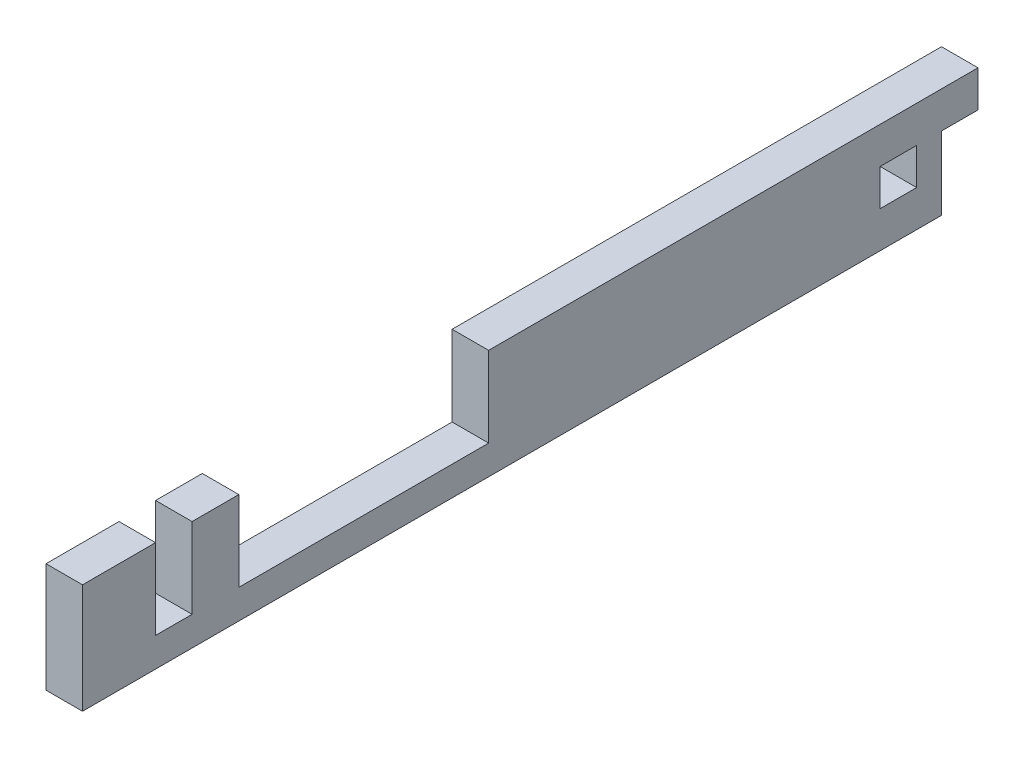
ISO-10303-21;
HEADER;
FILE_DESCRIPTION(('STEP AP214'),'2;1');
FILE_NAME('part.step','',(''),(''),'','','');
FILE_SCHEMA(('AUTOMOTIVE_DESIGN { 1 0 10303 214 1 1 1 1 }'));
ENDSEC;
DATA;
#1=APPLICATION_CONTEXT('core data for automotive mechanical design processes');
#2=APPLICATION_PROTOCOL_DEFINITION('international standard','automotive_design',2000,#1);
#3=PRODUCT_CONTEXT('',#1,'mechanical');
#4=PRODUCT('Part','Part','',(#3));
#5=PRODUCT_RELATED_PRODUCT_CATEGORY('part','',(#4));
#6=PRODUCT_DEFINITION_FORMATION('','',#4);
#7=PRODUCT_DEFINITION_CONTEXT('part definition',#1,'design');
#8=PRODUCT_DEFINITION('design','',#6,#7);
#9=PRODUCT_DEFINITION_SHAPE('','',#8);
#10=(LENGTH_UNIT() NAMED_UNIT(*) SI_UNIT(.MILLI.,.METRE.));
#11=(NAMED_UNIT(*) PLANE_ANGLE_UNIT() SI_UNIT($,.RADIAN.));
#12=(NAMED_UNIT(*) SI_UNIT($,.STERADIAN.) SOLID_ANGLE_UNIT());
#13=UNCERTAINTY_MEASURE_WITH_UNIT(LENGTH_MEASURE(1.E-05),#10,'distance_accuracy_value','');
#14=(GEOMETRIC_REPRESENTATION_CONTEXT(3) GLOBAL_UNCERTAINTY_ASSIGNED_CONTEXT((#13)) GLOBAL_UNIT_ASSIGNED_CONTEXT((#10,
#11,#12)) REPRESENTATION_CONTEXT('',''));
#15=CARTESIAN_POINT('',(0.,0.,0.));
#16=DIRECTION('',(0.,0.,1.));
#17=DIRECTION('',(1.,0.,0.));
#18=AXIS2_PLACEMENT_3D('',#15,#16,#17);
#19=CARTESIAN_POINT('',(0.,19.05,0.));
#20=DIRECTION('',(0.,1.,0.));
#21=DIRECTION('',(0.,0.,1.));
#22=AXIS2_PLACEMENT_3D('',#19,#20,#21);
#23=PLANE('',#22);
#24=DIRECTION('',(-1.,0.,0.));
#25=VECTOR('',#24,1.);
#26=CARTESIAN_POINT('',(0.,19.05,8.255));
#27=LINE('',#26,#25);
#28=CARTESIAN_POINT('',(-11.6205,19.05,8.255));
#29=VERTEX_POINT('',#28);
#30=CARTESIAN_POINT('',(-17.9705,19.05,8.255));
#31=VERTEX_POINT('',#30);
#32=EDGE_CURVE('E272',#29,#31,#27,.T.);
#33=ORIENTED_EDGE('',*,*,#32,.F.);
#34=DIRECTION('',(0.,0.,-1.));
#35=VECTOR('',#34,1.);
#36=CARTESIAN_POINT('',(-11.6205,19.05,-76.835));
#37=LINE('',#36,#35);
#38=CARTESIAN_POINT('',(-11.6205,19.05,-76.835));
#39=VERTEX_POINT('',#38);
#40=EDGE_CURVE('E230',#29,#39,#37,.T.);
#41=ORIENTED_EDGE('',*,*,#40,.T.);
#42=DIRECTION('',(-1.,0.,0.));
#43=VECTOR('',#42,1.);
#44=CARTESIAN_POINT('',(-17.9705,19.05,-76.835));
#45=LINE('',#44,#43);
#46=CARTESIAN_POINT('',(-17.9705,19.05,-76.835));
#47=VERTEX_POINT('',#46);
#48=EDGE_CURVE('E232',#39,#47,#45,.T.);
#49=ORIENTED_EDGE('',*,*,#48,.T.);
#50=DIRECTION('',(0.,0.,1.));
#51=VECTOR('',#50,1.);
#52=CARTESIAN_POINT('',(-17.9705,19.05,78.867));
#53=LINE('',#52,#51);
#54=EDGE_CURVE('E235',#47,#31,#53,.T.);
#55=ORIENTED_EDGE('',*,*,#54,.T.);
#56=EDGE_LOOP('',(#33,#41,#49,#55));
#57=FACE_BOUND('',#56,.T.);
#58=ADVANCED_FACE('F36',(#57),#23,.T.);
#59=CARTESIAN_POINT('',(0.,0.,0.));
#60=DIRECTION('',(0.,1.,0.));
#61=DIRECTION('',(0.,0.,1.));
#62=AXIS2_PLACEMENT_3D('',#59,#60,#61);
#63=PLANE('',#62);
#64=DIRECTION('',(0.,0.,-1.));
#65=VECTOR('',#64,1.);
#66=CARTESIAN_POINT('',(-11.6205,0.,59.817));
#67=LINE('',#66,#65);
#68=CARTESIAN_POINT('',(-11.6205,0.,78.867));
#69=VERTEX_POINT('',#68);
#70=CARTESIAN_POINT('',(-11.6205,0.,-70.485));
#71=VERTEX_POINT('',#70);
#72=EDGE_CURVE('E59',#69,#71,#67,.T.);
#73=ORIENTED_EDGE('',*,*,#72,.F.);
#74=DIRECTION('',(1.,0.,0.));
#75=VECTOR('',#74,1.);
#76=CARTESIAN_POINT('',(-17.9705,0.,78.867));
#77=LINE('',#76,#75);
#78=CARTESIAN_POINT('',(-17.9705,0.,78.867));
#79=VERTEX_POINT('',#78);
#80=EDGE_CURVE('E248',#79,#69,#77,.T.);
#81=ORIENTED_EDGE('',*,*,#80,.F.);
#82=DIRECTION('',(0.,0.,1.));
#83=VECTOR('',#82,1.);
#84=CARTESIAN_POINT('',(-17.9705,0.,78.867));
#85=LINE('',#84,#83);
#86=CARTESIAN_POINT('',(-17.9705,0.,-70.485));
#87=VERTEX_POINT('',#86);
#88=EDGE_CURVE('E229',#87,#79,#85,.T.);
#89=ORIENTED_EDGE('',*,*,#88,.F.);
#90=DIRECTION('',(1.,0.,0.));
#91=VECTOR('',#90,1.);
#92=CARTESIAN_POINT('',(0.,0.,-70.485));
#93=LINE('',#92,#91);
#94=EDGE_CURVE('E277',#87,#71,#93,.T.);
#95=ORIENTED_EDGE('',*,*,#94,.T.);
#96=EDGE_LOOP('',(#73,#81,#89,#95));
#97=FACE_BOUND('',#96,.T.);
#98=ADVANCED_FACE('F333',(#97),#63,.F.);
#99=CARTESIAN_POINT('',(17.9705,5.08,59.817));
#100=DIRECTION('',(0.,-1.,0.));
#101=DIRECTION('',(0.,0.,-1.));
#102=AXIS2_PLACEMENT_3D('',#99,#100,#101);
#103=PLANE('',#102);
#104=DIRECTION('',(0.,0.,1.));
#105=VECTOR('',#104,1.);
#106=CARTESIAN_POINT('',(-11.6205,5.08,59.817));
#107=LINE('',#106,#105);
#108=CARTESIAN_POINT('',(-11.6205,5.08,59.817));
#109=VERTEX_POINT('',#108);
#110=CARTESIAN_POINT('',(-11.6205,5.08,66.167));
#111=VERTEX_POINT('',#110);
#112=EDGE_CURVE('E171',#109,#111,#107,.T.);
#113=ORIENTED_EDGE('',*,*,#112,.F.);
#114=DIRECTION('',(-1.,0.,0.));
#115=VECTOR('',#114,1.);
#116=CARTESIAN_POINT('',(17.9705,5.08,59.817));
#117=LINE('',#116,#115);
#118=CARTESIAN_POINT('',(-17.9705,5.08,59.817));
#119=VERTEX_POINT('',#118);
#120=EDGE_CURVE('E303',#109,#119,#117,.T.);
#121=ORIENTED_EDGE('',*,*,#120,.T.);
#122=DIRECTION('',(0.,0.,1.));
#123=VECTOR('',#122,1.);
#124=CARTESIAN_POINT('',(-17.9705,5.08,59.817));
#125=LINE('',#124,#123);
#126=CARTESIAN_POINT('',(-17.9705,5.08,66.167));
#127=VERTEX_POINT('',#126);
#128=EDGE_CURVE('E188',#119,#127,#125,.T.);
#129=ORIENTED_EDGE('',*,*,#128,.T.);
#130=DIRECTION('',(-1.,0.,0.));
#131=VECTOR('',#130,1.);
#132=CARTESIAN_POINT('',(17.9705,5.08,66.167));
#133=LINE('',#132,#131);
#134=EDGE_CURVE('E179',#111,#127,#133,.T.);
#135=ORIENTED_EDGE('',*,*,#134,.F.);
#136=EDGE_LOOP('',(#113,#121,#129,#135));
#137=FACE_BOUND('',#136,.T.);
#138=ADVANCED_FACE('F328',(#137),#103,.F.);
#139=CARTESIAN_POINT('',(17.9705,12.7,-66.167));
#140=DIRECTION('',(0.,1.,0.));
#141=DIRECTION('',(0.,0.,1.));
#142=AXIS2_PLACEMENT_3D('',#139,#140,#141);
#143=PLANE('',#142);
#144=DIRECTION('',(0.,0.,-1.));
#145=VECTOR('',#144,1.);
#146=CARTESIAN_POINT('',(-11.6205,12.7,-66.167));
#147=LINE('',#146,#145);
#148=CARTESIAN_POINT('',(-11.6205,12.7,-59.817));
#149=VERTEX_POINT('',#148);
#150=CARTESIAN_POINT('',(-11.6205,12.7,-66.167));
#151=VERTEX_POINT('',#150);
#152=EDGE_CURVE('E162',#149,#151,#147,.T.);
#153=ORIENTED_EDGE('',*,*,#152,.F.);
#154=DIRECTION('',(-1.,0.,0.));
#155=VECTOR('',#154,1.);
#156=CARTESIAN_POINT('',(17.9705,12.7,-59.817));
#157=LINE('',#156,#155);
#158=CARTESIAN_POINT('',(-17.9705,12.7,-59.817));
#159=VERTEX_POINT('',#158);
#160=EDGE_CURVE('E185',#149,#159,#157,.T.);
#161=ORIENTED_EDGE('',*,*,#160,.T.);
#162=DIRECTION('',(0.,0.,-1.));
#163=VECTOR('',#162,1.);
#164=CARTESIAN_POINT('',(-17.9705,12.7,-66.167));
#165=LINE('',#164,#163);
#166=CARTESIAN_POINT('',(-17.9705,12.7,-66.167));
#167=VERTEX_POINT('',#166);
#168=EDGE_CURVE('E183',#159,#167,#165,.T.);
#169=ORIENTED_EDGE('',*,*,#168,.T.);
#170=DIRECTION('',(-1.,0.,0.));
#171=VECTOR('',#170,1.);
#172=CARTESIAN_POINT('',(17.9705,12.7,-66.167));
#173=LINE('',#172,#171);
#174=EDGE_CURVE('E175',#151,#167,#173,.T.);
#175=ORIENTED_EDGE('',*,*,#174,.F.);
#176=EDGE_LOOP('',(#153,#161,#169,#175));
#177=FACE_BOUND('',#176,.T.);
#178=ADVANCED_FACE('F181',(#177),#143,.F.);
#179=CARTESIAN_POINT('',(17.9705,6.35,-66.167));
#180=DIRECTION('',(0.,-1.,0.));
#181=DIRECTION('',(0.,0.,-1.));
#182=AXIS2_PLACEMENT_3D('',#179,#180,#181);
#183=PLANE('',#182);
#184=DIRECTION('',(0.,0.,1.));
#185=VECTOR('',#184,1.);
#186=CARTESIAN_POINT('',(-11.6205,6.35,-66.167));
#187=LINE('',#186,#185);
#188=CARTESIAN_POINT('',(-11.6205,6.35,-66.167));
#189=VERTEX_POINT('',#188);
#190=CARTESIAN_POINT('',(-11.6205,6.35,-59.817));
#191=VERTEX_POINT('',#190);
#192=EDGE_CURVE('E172',#189,#191,#187,.T.);
#193=ORIENTED_EDGE('',*,*,#192,.F.);
#194=DIRECTION('',(-1.,0.,0.));
#195=VECTOR('',#194,1.);
#196=CARTESIAN_POINT('',(17.9705,6.35,-66.167));
#197=LINE('',#196,#195);
#198=CARTESIAN_POINT('',(-17.9705,6.35,-66.167));
#199=VERTEX_POINT('',#198);
#200=EDGE_CURVE('E177',#189,#199,#197,.T.);
#201=ORIENTED_EDGE('',*,*,#200,.T.);
#202=DIRECTION('',(0.,0.,1.));
#203=VECTOR('',#202,1.);
#204=CARTESIAN_POINT('',(-17.9705,6.35,-66.167));
#205=LINE('',#204,#203);
#206=CARTESIAN_POINT('',(-17.9705,6.35,-59.817));
#207=VERTEX_POINT('',#206);
#208=EDGE_CURVE('E296',#199,#207,#205,.T.);
#209=ORIENTED_EDGE('',*,*,#208,.T.);
#210=DIRECTION('',(-1.,0.,0.));
#211=VECTOR('',#210,1.);
#212=CARTESIAN_POINT('',(17.9705,6.35,-59.817));
#213=LINE('',#212,#211);
#214=EDGE_CURVE('E190',#191,#207,#213,.T.);
#215=ORIENTED_EDGE('',*,*,#214,.F.);
#216=EDGE_LOOP('',(#193,#201,#209,#215));
#217=FACE_BOUND('',#216,.T.);
#218=ADVANCED_FACE('F318',(#217),#183,.F.);
#219=DIRECTION('',(-1.,0.,0.));
#220=VECTOR('',#219,1.);
#221=CARTESIAN_POINT('',(0.,19.05,59.817));
#222=LINE('',#221,#220);
#223=CARTESIAN_POINT('',(-11.6205,19.05,59.817));
#224=VERTEX_POINT('',#223);
#225=CARTESIAN_POINT('',(-17.9705,19.05,59.817));
#226=VERTEX_POINT('',#225);
#227=EDGE_CURVE('E11',#224,#226,#222,.T.);
#228=ORIENTED_EDGE('',*,*,#227,.F.);
#229=DIRECTION('',(0.,0.,-1.));
#230=VECTOR('',#229,1.);
#231=CARTESIAN_POINT('',(-11.6205,19.05,59.817));
#232=LINE('',#231,#230);
#233=CARTESIAN_POINT('',(-11.6205,19.05,51.689));
#234=VERTEX_POINT('',#233);
#235=EDGE_CURVE('E244',#224,#234,#232,.T.);
#236=ORIENTED_EDGE('',*,*,#235,.T.);
#237=DIRECTION('',(1.,0.,0.));
#238=VECTOR('',#237,1.);
#239=CARTESIAN_POINT('',(0.,19.05,51.689));
#240=LINE('',#239,#238);
#241=CARTESIAN_POINT('',(-17.9705,19.05,51.689));
#242=VERTEX_POINT('',#241);
#243=EDGE_CURVE('E270',#242,#234,#240,.T.);
#244=ORIENTED_EDGE('',*,*,#243,.F.);
#245=EDGE_CURVE('E239',#242,#226,#53,.T.);
#246=ORIENTED_EDGE('',*,*,#245,.T.);
#247=EDGE_LOOP('',(#228,#236,#244,#246));
#248=FACE_BOUND('',#247,.T.);
#249=ADVANCED_FACE('F320',(#248),#23,.T.);
#250=DIRECTION('',(1.,0.,0.));
#251=VECTOR('',#250,1.);
#252=CARTESIAN_POINT('',(0.,19.05,66.167));
#253=LINE('',#252,#251);
#254=CARTESIAN_POINT('',(-17.9705,19.05,66.167));
#255=VERTEX_POINT('',#254);
#256=CARTESIAN_POINT('',(-11.6205,19.05,66.167));
#257=VERTEX_POINT('',#256);
#258=EDGE_CURVE('E44',#255,#257,#253,.T.);
#259=ORIENTED_EDGE('',*,*,#258,.F.);
#260=CARTESIAN_POINT('',(-17.9705,19.05,78.867));
#261=VERTEX_POINT('',#260);
#262=EDGE_CURVE('E234',#255,#261,#53,.T.);
#263=ORIENTED_EDGE('',*,*,#262,.T.);
#264=DIRECTION('',(1.,0.,0.));
#265=VECTOR('',#264,1.);
#266=CARTESIAN_POINT('',(-17.9705,19.05,78.867));
#267=LINE('',#266,#265);
#268=CARTESIAN_POINT('',(-11.6205,19.05,78.867));
#269=VERTEX_POINT('',#268);
#270=EDGE_CURVE('E238',#261,#269,#267,.T.);
#271=ORIENTED_EDGE('',*,*,#270,.T.);
#272=DIRECTION('',(0.,0.,-1.));
#273=VECTOR('',#272,1.);
#274=CARTESIAN_POINT('',(-11.6205,19.05,66.167));
#275=LINE('',#274,#273);
#276=EDGE_CURVE('E241',#269,#257,#275,.T.);
#277=ORIENTED_EDGE('',*,*,#276,.T.);
#278=EDGE_LOOP('',(#259,#263,#271,#277));
#279=FACE_BOUND('',#278,.T.);
#280=ADVANCED_FACE('F289',(#279),#23,.T.);
#281=CARTESIAN_POINT('',(-17.9705,19.05,-76.835));
#282=DIRECTION('',(0.,0.,1.));
#283=DIRECTION('',(1.,0.,0.));
#284=AXIS2_PLACEMENT_3D('',#281,#282,#283);
#285=PLANE('',#284);
#286=DIRECTION('',(0.,-1.,0.));
#287=VECTOR('',#286,1.);
#288=CARTESIAN_POINT('',(-11.6205,19.05,-76.835));
#289=LINE('',#288,#287);
#290=CARTESIAN_POINT('',(-11.6205,12.7,-76.835));
#291=VERTEX_POINT('',#290);
#292=EDGE_CURVE('E267',#39,#291,#289,.T.);
#293=ORIENTED_EDGE('',*,*,#292,.T.);
#294=DIRECTION('',(-1.,0.,0.));
#295=VECTOR('',#294,1.);
#296=CARTESIAN_POINT('',(17.9705,12.7,-76.835));
#297=LINE('',#296,#295);
#298=CARTESIAN_POINT('',(-17.9705,12.7,-76.835));
#299=VERTEX_POINT('',#298);
#300=EDGE_CURVE('E202',#291,#299,#297,.T.);
#301=ORIENTED_EDGE('',*,*,#300,.T.);
#302=DIRECTION('',(0.,-1.,0.));
#303=VECTOR('',#302,1.);
#304=CARTESIAN_POINT('',(-17.9705,19.05,-76.835));
#305=LINE('',#304,#303);
#306=EDGE_CURVE('E264',#47,#299,#305,.T.);
#307=ORIENTED_EDGE('',*,*,#306,.F.);
#308=ORIENTED_EDGE('',*,*,#48,.F.);
#309=EDGE_LOOP('',(#293,#301,#307,#308));
#310=FACE_BOUND('',#309,.T.);
#311=ADVANCED_FACE('F38',(#310),#285,.F.);
#312=CARTESIAN_POINT('',(-17.9705,19.05,78.867));
#313=DIRECTION('',(1.,0.,0.));
#314=DIRECTION('',(0.,0.,-1.));
#315=AXIS2_PLACEMENT_3D('',#312,#313,#314);
#316=PLANE('',#315);
#317=ORIENTED_EDGE('',*,*,#208,.F.);
#318=DIRECTION('',(0.,-1.,0.));
#319=VECTOR('',#318,1.);
#320=CARTESIAN_POINT('',(-17.9705,12.7,-66.167));
#321=LINE('',#320,#319);
#322=EDGE_CURVE('E51',#167,#199,#321,.T.);
#323=ORIENTED_EDGE('',*,*,#322,.F.);
#324=ORIENTED_EDGE('',*,*,#168,.F.);
#325=DIRECTION('',(0.,1.,0.));
#326=VECTOR('',#325,1.);
#327=CARTESIAN_POINT('',(-17.9705,12.7,-59.817));
#328=LINE('',#327,#326);
#329=EDGE_CURVE('E307',#207,#159,#328,.T.);
#330=ORIENTED_EDGE('',*,*,#329,.F.);
#331=EDGE_LOOP('',(#317,#323,#324,#330));
#332=FACE_BOUND('',#331,.T.);
#333=ORIENTED_EDGE('',*,*,#128,.F.);
#334=DIRECTION('',(0.,-1.,0.));
#335=VECTOR('',#334,1.);
#336=CARTESIAN_POINT('',(-17.9705,19.05,59.817));
#337=LINE('',#336,#335);
#338=EDGE_CURVE('E184',#226,#119,#337,.T.);
#339=ORIENTED_EDGE('',*,*,#338,.F.);
#340=ORIENTED_EDGE('',*,*,#245,.F.);
#341=DIRECTION('',(0.,1.,0.));
#342=VECTOR('',#341,1.);
#343=CARTESIAN_POINT('',(-17.9705,19.05,51.689));
#344=LINE('',#343,#342);
#345=CARTESIAN_POINT('',(-17.9705,5.08,51.689));
#346=VERTEX_POINT('',#345);
#347=EDGE_CURVE('E217',#346,#242,#344,.T.);
#348=ORIENTED_EDGE('',*,*,#347,.F.);
#349=DIRECTION('',(0.,0.,1.));
#350=VECTOR('',#349,1.);
#351=CARTESIAN_POINT('',(-17.9705,5.08,8.255));
#352=LINE('',#351,#350);
#353=CARTESIAN_POINT('',(-17.9705,5.08,8.255));
#354=VERTEX_POINT('',#353);
#355=EDGE_CURVE('E214',#354,#346,#352,.T.);
#356=ORIENTED_EDGE('',*,*,#355,.F.);
#357=DIRECTION('',(0.,-1.,0.));
#358=VECTOR('',#357,1.);
#359=CARTESIAN_POINT('',(-17.9705,19.05,8.255));
#360=LINE('',#359,#358);
#361=EDGE_CURVE('E211',#31,#354,#360,.T.);
#362=ORIENTED_EDGE('',*,*,#361,.F.);
#363=ORIENTED_EDGE('',*,*,#54,.F.);
#364=ORIENTED_EDGE('',*,*,#306,.T.);
#365=DIRECTION('',(0.,0.,-1.));
#366=VECTOR('',#365,1.);
#367=CARTESIAN_POINT('',(-17.9705,12.7,-76.835));
#368=LINE('',#367,#366);
#369=CARTESIAN_POINT('',(-17.9705,12.7,-70.485));
#370=VERTEX_POINT('',#369);
#371=EDGE_CURVE('E199',#370,#299,#368,.T.);
#372=ORIENTED_EDGE('',*,*,#371,.F.);
#373=DIRECTION('',(0.,1.,0.));
#374=VECTOR('',#373,1.);
#375=CARTESIAN_POINT('',(-17.9705,0.,-70.485));
#376=LINE('',#375,#374);
#377=EDGE_CURVE('E178',#87,#370,#376,.T.);
#378=ORIENTED_EDGE('',*,*,#377,.F.);
#379=ORIENTED_EDGE('',*,*,#88,.T.);
#380=DIRECTION('',(0.,-1.,0.));
#381=VECTOR('',#380,1.);
#382=CARTESIAN_POINT('',(-17.9705,19.05,78.867));
#383=LINE('',#382,#381);
#384=EDGE_CURVE('E261',#261,#79,#383,.T.);
#385=ORIENTED_EDGE('',*,*,#384,.F.);
#386=ORIENTED_EDGE('',*,*,#262,.F.);
#387=DIRECTION('',(0.,1.,0.));
#388=VECTOR('',#387,1.);
#389=CARTESIAN_POINT('',(-17.9705,19.05,66.167));
#390=LINE('',#389,#388);
#391=EDGE_CURVE('E285',#127,#255,#390,.T.);
#392=ORIENTED_EDGE('',*,*,#391,.F.);
#393=EDGE_LOOP('',(#333,#339,#340,#348,#356,#362,#363,#364,#372,#378,#379,#385,#386,#392));
#394=FACE_BOUND('',#393,.T.);
#395=ADVANCED_FACE('F315',(#332,#394),#316,.F.);
#396=CARTESIAN_POINT('',(-17.9705,19.05,78.867));
#397=DIRECTION('',(0.,0.,-1.));
#398=DIRECTION('',(-1.,0.,0.));
#399=AXIS2_PLACEMENT_3D('',#396,#397,#398);
#400=PLANE('',#399);
#401=ORIENTED_EDGE('',*,*,#80,.T.);
#402=DIRECTION('',(0.,-1.,0.));
#403=VECTOR('',#402,1.);
#404=CARTESIAN_POINT('',(-11.6205,19.05,78.867));
#405=LINE('',#404,#403);
#406=EDGE_CURVE('E259',#269,#69,#405,.T.);
#407=ORIENTED_EDGE('',*,*,#406,.F.);
#408=ORIENTED_EDGE('',*,*,#270,.F.);
#409=ORIENTED_EDGE('',*,*,#384,.T.);
#410=EDGE_LOOP('',(#401,#407,#408,#409));
#411=FACE_BOUND('',#410,.T.);
#412=ADVANCED_FACE('F350',(#411),#400,.F.);
#413=CARTESIAN_POINT('',(-11.6205,19.05,59.817));
#414=DIRECTION('',(-1.,0.,0.));
#415=DIRECTION('',(0.,0.,1.));
#416=AXIS2_PLACEMENT_3D('',#413,#414,#415);
#417=PLANE('',#416);
#418=ORIENTED_EDGE('',*,*,#152,.T.);
#419=DIRECTION('',(0.,-1.,0.));
#420=VECTOR('',#419,1.);
#421=CARTESIAN_POINT('',(-11.6205,19.05,-66.167));
#422=LINE('',#421,#420);
#423=EDGE_CURVE('E165',#151,#189,#422,.T.);
#424=ORIENTED_EDGE('',*,*,#423,.T.);
#425=ORIENTED_EDGE('',*,*,#192,.T.);
#426=DIRECTION('',(0.,-1.,0.));
#427=VECTOR('',#426,1.);
#428=CARTESIAN_POINT('',(-11.6205,19.05,-59.817));
#429=LINE('',#428,#427);
#430=EDGE_CURVE('E167',#149,#191,#429,.T.);
#431=ORIENTED_EDGE('',*,*,#430,.F.);
#432=EDGE_LOOP('',(#418,#424,#425,#431));
#433=FACE_BOUND('',#432,.T.);
#434=ORIENTED_EDGE('',*,*,#40,.F.);
#435=DIRECTION('',(0.,-1.,0.));
#436=VECTOR('',#435,1.);
#437=CARTESIAN_POINT('',(-11.6205,19.05,8.255));
#438=LINE('',#437,#436);
#439=CARTESIAN_POINT('',(-11.6205,5.08,8.255));
#440=VERTEX_POINT('',#439);
#441=EDGE_CURVE('E226',#29,#440,#438,.T.);
#442=ORIENTED_EDGE('',*,*,#441,.T.);
#443=DIRECTION('',(0.,0.,1.));
#444=VECTOR('',#443,1.);
#445=CARTESIAN_POINT('',(-11.6205,5.08,59.817));
#446=LINE('',#445,#444);
#447=CARTESIAN_POINT('',(-11.6205,5.08,51.689));
#448=VERTEX_POINT('',#447);
#449=EDGE_CURVE('E274',#440,#448,#446,.T.);
#450=ORIENTED_EDGE('',*,*,#449,.T.);
#451=DIRECTION('',(0.,1.,0.));
#452=VECTOR('',#451,1.);
#453=CARTESIAN_POINT('',(-11.6205,19.05,51.689));
#454=LINE('',#453,#452);
#455=EDGE_CURVE('E222',#448,#234,#454,.T.);
#456=ORIENTED_EDGE('',*,*,#455,.T.);
#457=ORIENTED_EDGE('',*,*,#235,.F.);
#458=DIRECTION('',(0.,-1.,0.));
#459=VECTOR('',#458,1.);
#460=CARTESIAN_POINT('',(-11.6205,19.05,59.817));
#461=LINE('',#460,#459);
#462=EDGE_CURVE('E253',#224,#109,#461,.T.);
#463=ORIENTED_EDGE('',*,*,#462,.T.);
#464=ORIENTED_EDGE('',*,*,#112,.T.);
#465=DIRECTION('',(0.,-1.,0.));
#466=VECTOR('',#465,1.);
#467=CARTESIAN_POINT('',(-11.6205,19.05,66.167));
#468=LINE('',#467,#466);
#469=EDGE_CURVE('E256',#257,#111,#468,.T.);
#470=ORIENTED_EDGE('',*,*,#469,.F.);
#471=ORIENTED_EDGE('',*,*,#276,.F.);
#472=ORIENTED_EDGE('',*,*,#406,.T.);
#473=ORIENTED_EDGE('',*,*,#72,.T.);
#474=DIRECTION('',(0.,1.,0.));
#475=VECTOR('',#474,1.);
#476=CARTESIAN_POINT('',(-11.6205,19.05,-70.485));
#477=LINE('',#476,#475);
#478=CARTESIAN_POINT('',(-11.6205,12.7,-70.485));
#479=VERTEX_POINT('',#478);
#480=EDGE_CURVE('E205',#71,#479,#477,.T.);
#481=ORIENTED_EDGE('',*,*,#480,.T.);
#482=DIRECTION('',(0.,0.,-1.));
#483=VECTOR('',#482,1.);
#484=CARTESIAN_POINT('',(-11.6205,12.7,-76.835));
#485=LINE('',#484,#483);
#486=EDGE_CURVE('E208',#479,#291,#485,.T.);
#487=ORIENTED_EDGE('',*,*,#486,.T.);
#488=ORIENTED_EDGE('',*,*,#292,.F.);
#489=EDGE_LOOP('',(#434,#442,#450,#456,#457,#463,#464,#470,#471,#472,#473,#481,#487,#488));
#490=FACE_BOUND('',#489,.T.);
#491=ADVANCED_FACE('F164',(#433,#490),#417,.F.);
#492=CARTESIAN_POINT('',(1.07950000000002,5.08,8.255));
#493=DIRECTION('',(0.,-1.,0.));
#494=DIRECTION('',(0.,0.,-1.));
#495=AXIS2_PLACEMENT_3D('',#492,#493,#494);
#496=PLANE('',#495);
#497=DIRECTION('',(-1.,0.,0.));
#498=VECTOR('',#497,1.);
#499=CARTESIAN_POINT('',(1.07950000000002,5.08,8.255));
#500=LINE('',#499,#498);
#501=EDGE_CURVE('E219',#440,#354,#500,.T.);
#502=ORIENTED_EDGE('',*,*,#501,.T.);
#503=ORIENTED_EDGE('',*,*,#355,.T.);
#504=DIRECTION('',(-1.,0.,0.));
#505=VECTOR('',#504,1.);
#506=CARTESIAN_POINT('',(1.07950000000002,5.08,51.689));
#507=LINE('',#506,#505);
#508=EDGE_CURVE('E220',#448,#346,#507,.T.);
#509=ORIENTED_EDGE('',*,*,#508,.F.);
#510=ORIENTED_EDGE('',*,*,#449,.F.);
#511=EDGE_LOOP('',(#502,#503,#509,#510));
#512=FACE_BOUND('',#511,.T.);
#513=ADVANCED_FACE('F372',(#512),#496,.F.);
#514=CARTESIAN_POINT('',(1.07950000000002,19.05,8.255));
#515=DIRECTION('',(0.,0.,-1.));
#516=DIRECTION('',(-1.,0.,0.));
#517=AXIS2_PLACEMENT_3D('',#514,#515,#516);
#518=PLANE('',#517);
#519=ORIENTED_EDGE('',*,*,#32,.T.);
#520=ORIENTED_EDGE('',*,*,#361,.T.);
#521=ORIENTED_EDGE('',*,*,#501,.F.);
#522=ORIENTED_EDGE('',*,*,#441,.F.);
#523=EDGE_LOOP('',(#519,#520,#521,#522));
#524=FACE_BOUND('',#523,.T.);
#525=ADVANCED_FACE('F368',(#524),#518,.F.);
#526=CARTESIAN_POINT('',(1.07950000000002,19.05,51.689));
#527=DIRECTION('',(0.,0.,1.));
#528=DIRECTION('',(1.,0.,0.));
#529=AXIS2_PLACEMENT_3D('',#526,#527,#528);
#530=PLANE('',#529);
#531=ORIENTED_EDGE('',*,*,#508,.T.);
#532=ORIENTED_EDGE('',*,*,#347,.T.);
#533=ORIENTED_EDGE('',*,*,#243,.T.);
#534=ORIENTED_EDGE('',*,*,#455,.F.);
#535=EDGE_LOOP('',(#531,#532,#533,#534));
#536=FACE_BOUND('',#535,.T.);
#537=ADVANCED_FACE('F375',(#536),#530,.F.);
#538=CARTESIAN_POINT('',(17.9705,12.7,-76.835));
#539=DIRECTION('',(0.,1.,0.));
#540=DIRECTION('',(0.,0.,1.));
#541=AXIS2_PLACEMENT_3D('',#538,#539,#540);
#542=PLANE('',#541);
#543=DIRECTION('',(-1.,0.,0.));
#544=VECTOR('',#543,1.);
#545=CARTESIAN_POINT('',(17.9705,12.7,-70.485));
#546=LINE('',#545,#544);
#547=EDGE_CURVE('E201',#479,#370,#546,.T.);
#548=ORIENTED_EDGE('',*,*,#547,.T.);
#549=ORIENTED_EDGE('',*,*,#371,.T.);
#550=ORIENTED_EDGE('',*,*,#300,.F.);
#551=ORIENTED_EDGE('',*,*,#486,.F.);
#552=EDGE_LOOP('',(#548,#549,#550,#551));
#553=FACE_BOUND('',#552,.T.);
#554=ADVANCED_FACE('F357',(#553),#542,.F.);
#555=CARTESIAN_POINT('',(17.9705,0.,-70.485));
#556=DIRECTION('',(0.,0.,1.));
#557=DIRECTION('',(1.,0.,0.));
#558=AXIS2_PLACEMENT_3D('',#555,#556,#557);
#559=PLANE('',#558);
#560=ORIENTED_EDGE('',*,*,#94,.F.);
#561=ORIENTED_EDGE('',*,*,#377,.T.);
#562=ORIENTED_EDGE('',*,*,#547,.F.);
#563=ORIENTED_EDGE('',*,*,#480,.F.);
#564=EDGE_LOOP('',(#560,#561,#562,#563));
#565=FACE_BOUND('',#564,.T.);
#566=ADVANCED_FACE('F359',(#565),#559,.F.);
#567=CARTESIAN_POINT('',(17.9705,19.05,59.817));
#568=DIRECTION('',(0.,0.,-1.));
#569=DIRECTION('',(-1.,0.,0.));
#570=AXIS2_PLACEMENT_3D('',#567,#568,#569);
#571=PLANE('',#570);
#572=ORIENTED_EDGE('',*,*,#227,.T.);
#573=ORIENTED_EDGE('',*,*,#338,.T.);
#574=ORIENTED_EDGE('',*,*,#120,.F.);
#575=ORIENTED_EDGE('',*,*,#462,.F.);
#576=EDGE_LOOP('',(#572,#573,#574,#575));
#577=FACE_BOUND('',#576,.T.);
#578=ADVANCED_FACE('F402',(#577),#571,.F.);
#579=CARTESIAN_POINT('',(17.9705,19.05,66.167));
#580=DIRECTION('',(0.,0.,1.));
#581=DIRECTION('',(1.,0.,0.));
#582=AXIS2_PLACEMENT_3D('',#579,#580,#581);
#583=PLANE('',#582);
#584=ORIENTED_EDGE('',*,*,#134,.T.);
#585=ORIENTED_EDGE('',*,*,#391,.T.);
#586=ORIENTED_EDGE('',*,*,#258,.T.);
#587=ORIENTED_EDGE('',*,*,#469,.T.);
#588=EDGE_LOOP('',(#584,#585,#586,#587));
#589=FACE_BOUND('',#588,.T.);
#590=ADVANCED_FACE('F281',(#589),#583,.F.);
#591=CARTESIAN_POINT('',(17.9705,12.7,-59.817));
#592=DIRECTION('',(0.,0.,1.));
#593=DIRECTION('',(1.,0.,0.));
#594=AXIS2_PLACEMENT_3D('',#591,#592,#593);
#595=PLANE('',#594);
#596=ORIENTED_EDGE('',*,*,#214,.T.);
#597=ORIENTED_EDGE('',*,*,#329,.T.);
#598=ORIENTED_EDGE('',*,*,#160,.F.);
#599=ORIENTED_EDGE('',*,*,#430,.T.);
#600=EDGE_LOOP('',(#596,#597,#598,#599));
#601=FACE_BOUND('',#600,.T.);
#602=ADVANCED_FACE('F311',(#601),#595,.F.);
#603=CARTESIAN_POINT('',(17.9705,12.7,-66.167));
#604=DIRECTION('',(0.,0.,-1.));
#605=DIRECTION('',(-1.,0.,0.));
#606=AXIS2_PLACEMENT_3D('',#603,#604,#605);
#607=PLANE('',#606);
#608=ORIENTED_EDGE('',*,*,#174,.T.);
#609=ORIENTED_EDGE('',*,*,#322,.T.);
#610=ORIENTED_EDGE('',*,*,#200,.F.);
#611=ORIENTED_EDGE('',*,*,#423,.F.);
#612=EDGE_LOOP('',(#608,#609,#610,#611));
#613=FACE_BOUND('',#612,.T.);
#614=ADVANCED_FACE('F174',(#613),#607,.F.);
#615=CLOSED_SHELL('',(#58,#98,#138,#178,#218,#249,#280,#311,#395,#412,#491,#513,#525,#537,#554,
#566,#578,#590,#602,#614));
#616=MANIFOLD_SOLID_BREP('B2',#615);
#617=ADVANCED_BREP_SHAPE_REPRESENTATION('',(#18,#616),#14);
#618=SHAPE_DEFINITION_REPRESENTATION(#9,#617);
ENDSEC;
END-ISO-10303-21;
